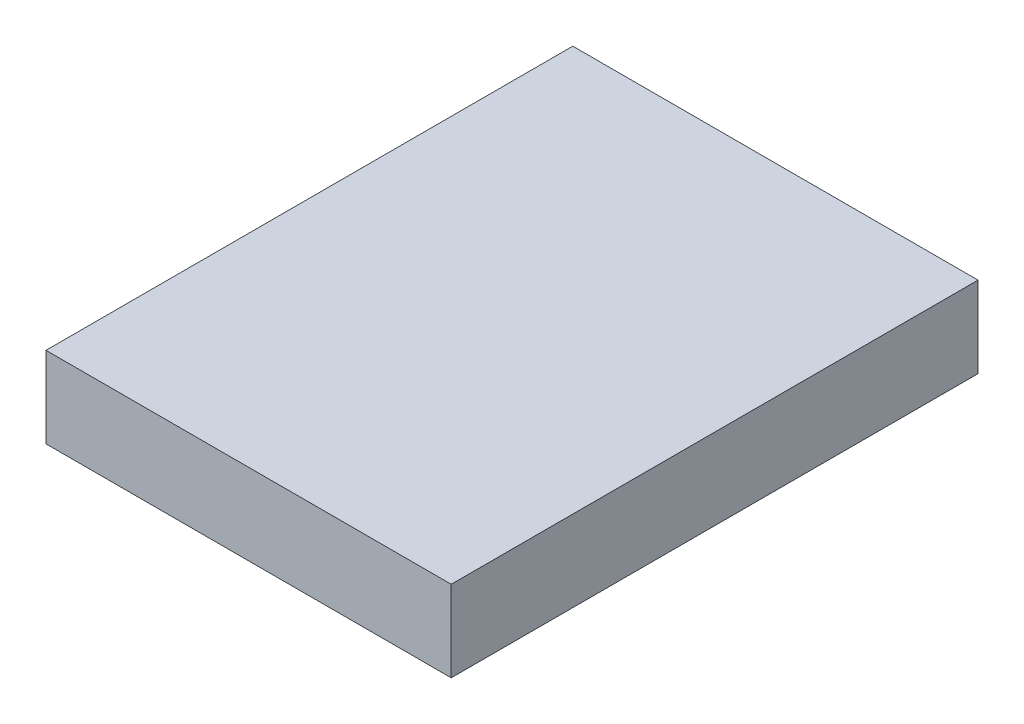
ISO-10303-21;
HEADER;
FILE_DESCRIPTION(('STEP AP214'),'2;1');
FILE_NAME('part.step','',(''),(''),'','','');
FILE_SCHEMA(('AUTOMOTIVE_DESIGN { 1 0 10303 214 1 1 1 1 }'));
ENDSEC;
DATA;
#1=APPLICATION_CONTEXT('core data for automotive mechanical design processes');
#2=APPLICATION_PROTOCOL_DEFINITION('international standard','automotive_design',2000,#1);
#3=PRODUCT_CONTEXT('',#1,'mechanical');
#4=PRODUCT('Part','Part','',(#3));
#5=PRODUCT_RELATED_PRODUCT_CATEGORY('part','',(#4));
#6=PRODUCT_DEFINITION_FORMATION('','',#4);
#7=PRODUCT_DEFINITION_CONTEXT('part definition',#1,'design');
#8=PRODUCT_DEFINITION('design','',#6,#7);
#9=PRODUCT_DEFINITION_SHAPE('','',#8);
#10=(LENGTH_UNIT() NAMED_UNIT(*) SI_UNIT(.MILLI.,.METRE.));
#11=(NAMED_UNIT(*) PLANE_ANGLE_UNIT() SI_UNIT($,.RADIAN.));
#12=(NAMED_UNIT(*) SI_UNIT($,.STERADIAN.) SOLID_ANGLE_UNIT());
#13=UNCERTAINTY_MEASURE_WITH_UNIT(LENGTH_MEASURE(1.E-05),#10,'distance_accuracy_value','');
#14=(GEOMETRIC_REPRESENTATION_CONTEXT(3) GLOBAL_UNCERTAINTY_ASSIGNED_CONTEXT((#13)) GLOBAL_UNIT_ASSIGNED_CONTEXT((#10,
#11,#12)) REPRESENTATION_CONTEXT('',''));
#15=CARTESIAN_POINT('',(0.,0.,0.));
#16=DIRECTION('',(0.,0.,1.));
#17=DIRECTION('',(1.,0.,0.));
#18=AXIS2_PLACEMENT_3D('',#15,#16,#17);
#19=CARTESIAN_POINT('',(50.,20.,65.));
#20=DIRECTION('',(-1.,0.,0.));
#21=DIRECTION('',(0.,0.,1.));
#22=AXIS2_PLACEMENT_3D('',#19,#20,#21);
#23=PLANE('',#22);
#24=DIRECTION('',(0.,0.,-1.));
#25=VECTOR('',#24,1.);
#26=CARTESIAN_POINT('',(50.,0.,65.));
#27=LINE('',#26,#25);
#28=CARTESIAN_POINT('',(50.,0.,65.));
#29=VERTEX_POINT('',#28);
#30=CARTESIAN_POINT('',(50.,0.,-65.));
#31=VERTEX_POINT('',#30);
#32=EDGE_CURVE('E97',#29,#31,#27,.T.);
#33=ORIENTED_EDGE('',*,*,#32,.T.);
#34=DIRECTION('',(0.,-1.,0.));
#35=VECTOR('',#34,1.);
#36=CARTESIAN_POINT('',(50.,20.,-65.));
#37=LINE('',#36,#35);
#38=CARTESIAN_POINT('',(50.,20.,-65.));
#39=VERTEX_POINT('',#38);
#40=EDGE_CURVE('E11',#39,#31,#37,.T.);
#41=ORIENTED_EDGE('',*,*,#40,.F.);
#42=DIRECTION('',(0.,0.,-1.));
#43=VECTOR('',#42,1.);
#44=CARTESIAN_POINT('',(50.,20.,65.));
#45=LINE('',#44,#43);
#46=CARTESIAN_POINT('',(50.,20.,65.));
#47=VERTEX_POINT('',#46);
#48=EDGE_CURVE('E85',#47,#39,#45,.T.);
#49=ORIENTED_EDGE('',*,*,#48,.F.);
#50=DIRECTION('',(0.,-1.,0.));
#51=VECTOR('',#50,1.);
#52=CARTESIAN_POINT('',(50.,20.,65.));
#53=LINE('',#52,#51);
#54=EDGE_CURVE('E93',#47,#29,#53,.T.);
#55=ORIENTED_EDGE('',*,*,#54,.T.);
#56=EDGE_LOOP('',(#33,#41,#49,#55));
#57=FACE_BOUND('',#56,.T.);
#58=ADVANCED_FACE('F34',(#57),#23,.F.);
#59=CARTESIAN_POINT('',(-50.,20.,-65.));
#60=DIRECTION('',(0.,0.,1.));
#61=DIRECTION('',(1.,0.,0.));
#62=AXIS2_PLACEMENT_3D('',#59,#60,#61);
#63=PLANE('',#62);
#64=DIRECTION('',(-1.,0.,0.));
#65=VECTOR('',#64,1.);
#66=CARTESIAN_POINT('',(-50.,0.,-65.));
#67=LINE('',#66,#65);
#68=CARTESIAN_POINT('',(-50.,0.,-65.));
#69=VERTEX_POINT('',#68);
#70=EDGE_CURVE('E89',#31,#69,#67,.T.);
#71=ORIENTED_EDGE('',*,*,#70,.T.);
#72=DIRECTION('',(0.,-1.,0.));
#73=VECTOR('',#72,1.);
#74=CARTESIAN_POINT('',(-50.,20.,-65.));
#75=LINE('',#74,#73);
#76=CARTESIAN_POINT('',(-50.,20.,-65.));
#77=VERTEX_POINT('',#76);
#78=EDGE_CURVE('E42',#77,#69,#75,.T.);
#79=ORIENTED_EDGE('',*,*,#78,.F.);
#80=DIRECTION('',(-1.,0.,0.));
#81=VECTOR('',#80,1.);
#82=CARTESIAN_POINT('',(-50.,20.,-65.));
#83=LINE('',#82,#81);
#84=EDGE_CURVE('E80',#39,#77,#83,.T.);
#85=ORIENTED_EDGE('',*,*,#84,.F.);
#86=ORIENTED_EDGE('',*,*,#40,.T.);
#87=EDGE_LOOP('',(#71,#79,#85,#86));
#88=FACE_BOUND('',#87,.T.);
#89=ADVANCED_FACE('F88',(#88),#63,.F.);
#90=CARTESIAN_POINT('',(-50.,20.,65.));
#91=DIRECTION('',(1.,0.,0.));
#92=DIRECTION('',(0.,0.,-1.));
#93=AXIS2_PLACEMENT_3D('',#90,#91,#92);
#94=PLANE('',#93);
#95=DIRECTION('',(0.,0.,1.));
#96=VECTOR('',#95,1.);
#97=CARTESIAN_POINT('',(-50.,0.,65.));
#98=LINE('',#97,#96);
#99=CARTESIAN_POINT('',(-50.,0.,65.));
#100=VERTEX_POINT('',#99);
#101=EDGE_CURVE('E67',#69,#100,#98,.T.);
#102=ORIENTED_EDGE('',*,*,#101,.T.);
#103=DIRECTION('',(0.,-1.,0.));
#104=VECTOR('',#103,1.);
#105=CARTESIAN_POINT('',(-50.,20.,65.));
#106=LINE('',#105,#104);
#107=CARTESIAN_POINT('',(-50.,20.,65.));
#108=VERTEX_POINT('',#107);
#109=EDGE_CURVE('E90',#108,#100,#106,.T.);
#110=ORIENTED_EDGE('',*,*,#109,.F.);
#111=DIRECTION('',(0.,0.,1.));
#112=VECTOR('',#111,1.);
#113=CARTESIAN_POINT('',(-50.,20.,65.));
#114=LINE('',#113,#112);
#115=EDGE_CURVE('E83',#77,#108,#114,.T.);
#116=ORIENTED_EDGE('',*,*,#115,.F.);
#117=ORIENTED_EDGE('',*,*,#78,.T.);
#118=EDGE_LOOP('',(#102,#110,#116,#117));
#119=FACE_BOUND('',#118,.T.);
#120=ADVANCED_FACE('F91',(#119),#94,.F.);
#121=CARTESIAN_POINT('',(-50.,20.,65.));
#122=DIRECTION('',(0.,0.,-1.));
#123=DIRECTION('',(-1.,0.,0.));
#124=AXIS2_PLACEMENT_3D('',#121,#122,#123);
#125=PLANE('',#124);
#126=DIRECTION('',(1.,0.,0.));
#127=VECTOR('',#126,1.);
#128=CARTESIAN_POINT('',(-50.,0.,65.));
#129=LINE('',#128,#127);
#130=EDGE_CURVE('E73',#100,#29,#129,.T.);
#131=ORIENTED_EDGE('',*,*,#130,.T.);
#132=ORIENTED_EDGE('',*,*,#54,.F.);
#133=DIRECTION('',(1.,0.,0.));
#134=VECTOR('',#133,1.);
#135=CARTESIAN_POINT('',(-50.,20.,65.));
#136=LINE('',#135,#134);
#137=EDGE_CURVE('E50',#108,#47,#136,.T.);
#138=ORIENTED_EDGE('',*,*,#137,.F.);
#139=ORIENTED_EDGE('',*,*,#109,.T.);
#140=EDGE_LOOP('',(#131,#132,#138,#139));
#141=FACE_BOUND('',#140,.T.);
#142=ADVANCED_FACE('F104',(#141),#125,.F.);
#143=CARTESIAN_POINT('',(0.,20.,0.));
#144=DIRECTION('',(0.,-1.,0.));
#145=DIRECTION('',(0.,0.,-1.));
#146=AXIS2_PLACEMENT_3D('',#143,#144,#145);
#147=PLANE('',#146);
#148=ORIENTED_EDGE('',*,*,#48,.T.);
#149=ORIENTED_EDGE('',*,*,#84,.T.);
#150=ORIENTED_EDGE('',*,*,#115,.T.);
#151=ORIENTED_EDGE('',*,*,#137,.T.);
#152=EDGE_LOOP('',(#148,#149,#150,#151));
#153=FACE_BOUND('',#152,.T.);
#154=ADVANCED_FACE('F81',(#153),#147,.F.);
#155=CARTESIAN_POINT('',(0.,0.,0.));
#156=DIRECTION('',(0.,-1.,0.));
#157=DIRECTION('',(0.,0.,-1.));
#158=AXIS2_PLACEMENT_3D('',#155,#156,#157);
#159=PLANE('',#158);
#160=ORIENTED_EDGE('',*,*,#32,.F.);
#161=ORIENTED_EDGE('',*,*,#130,.F.);
#162=ORIENTED_EDGE('',*,*,#101,.F.);
#163=ORIENTED_EDGE('',*,*,#70,.F.);
#164=EDGE_LOOP('',(#160,#161,#162,#163));
#165=FACE_BOUND('',#164,.T.);
#166=ADVANCED_FACE('F107',(#165),#159,.T.);
#167=CLOSED_SHELL('',(#58,#89,#120,#142,#154,#166));
#168=MANIFOLD_SOLID_BREP('B2',#167);
#169=ADVANCED_BREP_SHAPE_REPRESENTATION('',(#18,#168),#14);
#170=SHAPE_DEFINITION_REPRESENTATION(#9,#169);
ENDSEC;
END-ISO-10303-21;
